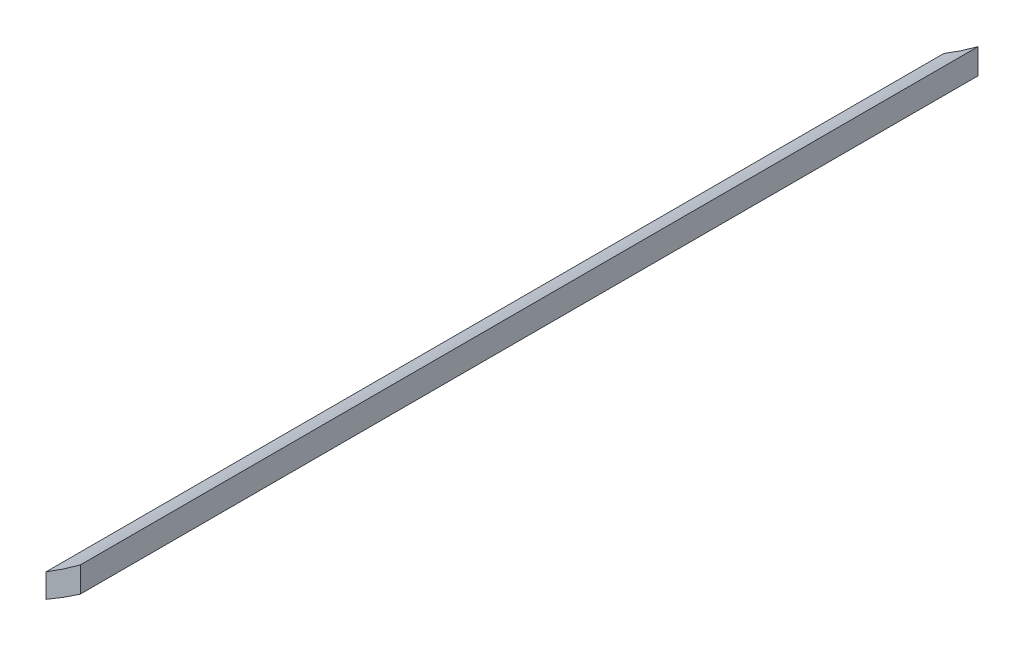
ISO-10303-21;
HEADER;
FILE_DESCRIPTION(('STEP AP214'),'2;1');
FILE_NAME('part.step','',(''),(''),'','','');
FILE_SCHEMA(('AUTOMOTIVE_DESIGN { 1 0 10303 214 1 1 1 1 }'));
ENDSEC;
DATA;
#1=APPLICATION_CONTEXT('core data for automotive mechanical design processes');
#2=APPLICATION_PROTOCOL_DEFINITION('international standard','automotive_design',2000,#1);
#3=PRODUCT_CONTEXT('',#1,'mechanical');
#4=PRODUCT('Part','Part','',(#3));
#5=PRODUCT_RELATED_PRODUCT_CATEGORY('part','',(#4));
#6=PRODUCT_DEFINITION_FORMATION('','',#4);
#7=PRODUCT_DEFINITION_CONTEXT('part definition',#1,'design');
#8=PRODUCT_DEFINITION('design','',#6,#7);
#9=PRODUCT_DEFINITION_SHAPE('','',#8);
#10=(LENGTH_UNIT() NAMED_UNIT(*) SI_UNIT(.MILLI.,.METRE.));
#11=(NAMED_UNIT(*) PLANE_ANGLE_UNIT() SI_UNIT($,.RADIAN.));
#12=(NAMED_UNIT(*) SI_UNIT($,.STERADIAN.) SOLID_ANGLE_UNIT());
#13=UNCERTAINTY_MEASURE_WITH_UNIT(LENGTH_MEASURE(1.E-05),#10,'distance_accuracy_value','');
#14=(GEOMETRIC_REPRESENTATION_CONTEXT(3) GLOBAL_UNCERTAINTY_ASSIGNED_CONTEXT((#13)) GLOBAL_UNIT_ASSIGNED_CONTEXT((#10,
#11,#12)) REPRESENTATION_CONTEXT('',''));
#15=CARTESIAN_POINT('',(0.,0.,0.));
#16=DIRECTION('',(0.,0.,1.));
#17=DIRECTION('',(1.,0.,0.));
#18=AXIS2_PLACEMENT_3D('',#15,#16,#17);
#19=CARTESIAN_POINT('',(124.258422810137,-49.206656057137,55.));
#20=CARTESIAN_POINT('',(123.864604952284,-49.4967683658135,55.));
#21=CARTESIAN_POINT('',(123.46498976773,-49.7784278854798,55.));
#22=CARTESIAN_POINT('',(122.76228468259,-50.2462797192281,55.));
#23=CARTESIAN_POINT('',(122.462623418311,-50.4374711545895,55.));
#24=CARTESIAN_POINT('',(122.158422810137,-50.6220440020814,55.));
#25=B_SPLINE_CURVE_WITH_KNOTS('',3,(#19,#20,#21,#22,#23,#24),.UNSPECIFIED.,.F.,.F.,(4,2,4),
(0.114062220421862,0.249999999999999,0.348787923125498),.UNSPECIFIED.);
#26=DIRECTION('',(0.,0.,-1.));
#27=VECTOR('',#26,1.);
#28=SURFACE_OF_LINEAR_EXTRUSION('',#25,#27);
#29=CARTESIAN_POINT('',(124.258422810137,-49.206656057137,0.));
#30=CARTESIAN_POINT('',(123.864604952284,-49.4967683658135,0.));
#31=CARTESIAN_POINT('',(123.46498976773,-49.7784278854798,0.));
#32=CARTESIAN_POINT('',(122.76228468259,-50.2462797192281,0.));
#33=CARTESIAN_POINT('',(122.462623418311,-50.4374711545895,0.));
#34=CARTESIAN_POINT('',(122.158422810137,-50.6220440020814,0.));
#35=B_SPLINE_CURVE_WITH_KNOTS('',3,(#29,#30,#31,#32,#33,#34),.UNSPECIFIED.,.F.,.F.,(4,2,4),
(0.114062220421862,0.249999999999999,0.348787923125498),.UNSPECIFIED.);
#36=CARTESIAN_POINT('',(124.258422810137,-49.2066560571371,0.));
#37=VERTEX_POINT('',#36);
#38=CARTESIAN_POINT('',(122.158422810137,-50.6220440020814,0.));
#39=VERTEX_POINT('',#38);
#40=EDGE_CURVE('E202',#37,#39,#35,.T.);
#41=ORIENTED_EDGE('',*,*,#40,.T.);
#42=DIRECTION('',(0.,0.,-1.));
#43=VECTOR('',#42,1.);
#44=CARTESIAN_POINT('',(122.158422810137,-50.6220440020814,55.));
#45=LINE('',#44,#43);
#46=CARTESIAN_POINT('',(122.158422810137,-50.6220440020814,55.));
#47=VERTEX_POINT('',#46);
#48=EDGE_CURVE('E11',#47,#39,#45,.T.);
#49=ORIENTED_EDGE('',*,*,#48,.F.);
#50=CARTESIAN_POINT('',(122.158422810137,-50.6220440020814,55.));
#51=CARTESIAN_POINT('',(122.462623418311,-50.4374711545895,55.));
#52=CARTESIAN_POINT('',(122.76228468259,-50.2462797192281,55.));
#53=CARTESIAN_POINT('',(123.46498976773,-49.7784278854798,55.));
#54=CARTESIAN_POINT('',(123.864604952284,-49.4967683658135,55.));
#55=CARTESIAN_POINT('',(124.258422810137,-49.206656057137,55.));
#56=B_SPLINE_CURVE_WITH_KNOTS('',3,(#50,#51,#52,#53,#54,#55),.UNSPECIFIED.,.F.,.F.,(4,2,4),
(0.114062220421862,0.212850143547361,0.348787923125498),.UNSPECIFIED.);
#57=CARTESIAN_POINT('',(124.258422810137,-49.2066560571371,55.));
#58=VERTEX_POINT('',#57);
#59=EDGE_CURVE('E99',#58,#47,#56,.F.);
#60=ORIENTED_EDGE('',*,*,#59,.F.);
#61=DIRECTION('',(0.,0.,-1.));
#62=VECTOR('',#61,1.);
#63=CARTESIAN_POINT('',(124.258422810137,-49.2066560571371,55.));
#64=LINE('',#63,#62);
#65=EDGE_CURVE('E187',#58,#37,#64,.T.);
#66=ORIENTED_EDGE('',*,*,#65,.T.);
#67=EDGE_LOOP('',(#41,#49,#60,#66));
#68=FACE_BOUND('',#67,.T.);
#69=ADVANCED_FACE('F39',(#68),#28,.F.);
#70=CARTESIAN_POINT('',(122.158422810137,-50.6220440020814,55.));
#71=DIRECTION('',(1.,0.,0.));
#72=DIRECTION('',(0.,0.,-1.));
#73=AXIS2_PLACEMENT_3D('',#70,#71,#72);
#74=PLANE('',#73);
#75=DIRECTION('',(0.,-1.,0.));
#76=VECTOR('',#75,1.);
#77=CARTESIAN_POINT('',(122.158422810137,-50.6220440020814,0.));
#78=LINE('',#77,#76);
#79=CARTESIAN_POINT('',(122.158422810137,-52.0819137652417,0.));
#80=VERTEX_POINT('',#79);
#81=EDGE_CURVE('E105',#39,#80,#78,.T.);
#82=ORIENTED_EDGE('',*,*,#81,.T.);
#83=DIRECTION('',(0.,0.,-1.));
#84=VECTOR('',#83,1.);
#85=CARTESIAN_POINT('',(122.158422810137,-52.0819137652417,55.));
#86=LINE('',#85,#84);
#87=CARTESIAN_POINT('',(122.158422810137,-52.0819137652417,55.));
#88=VERTEX_POINT('',#87);
#89=EDGE_CURVE('E53',#88,#80,#86,.T.);
#90=ORIENTED_EDGE('',*,*,#89,.F.);
#91=DIRECTION('',(0.,-1.,0.));
#92=VECTOR('',#91,1.);
#93=CARTESIAN_POINT('',(122.158422810137,-50.6220440020814,55.));
#94=LINE('',#93,#92);
#95=EDGE_CURVE('E93',#47,#88,#94,.T.);
#96=ORIENTED_EDGE('',*,*,#95,.F.);
#97=ORIENTED_EDGE('',*,*,#48,.T.);
#98=EDGE_LOOP('',(#82,#90,#96,#97));
#99=FACE_BOUND('',#98,.T.);
#100=ADVANCED_FACE('F104',(#99),#74,.F.);
#101=CARTESIAN_POINT('',(122.158422810137,-52.0819137652417,55.));
#102=CARTESIAN_POINT('',(122.466925520807,-51.9079399314948,55.));
#103=CARTESIAN_POINT('',(122.771253518607,-51.7267928018192,55.));
#104=CARTESIAN_POINT('',(123.473575804438,-51.2888831627379,55.));
#105=CARTESIAN_POINT('',(123.868912344743,-51.0270588173674,55.));
#106=CARTESIAN_POINT('',(124.258422810137,-50.7562014190225,55.));
#107=B_SPLINE_CURVE_WITH_KNOTS('',3,(#101,#102,#103,#104,#105,#106),.UNSPECIFIED.,.F.,.F.,(4,2,
4),(0.649205424795794,0.750000000000001,0.88522318251672),.UNSPECIFIED.);
#108=DIRECTION('',(0.,0.,-1.));
#109=VECTOR('',#108,1.);
#110=SURFACE_OF_LINEAR_EXTRUSION('',#107,#109);
#111=CARTESIAN_POINT('',(122.158422810137,-52.0819137652417,0.));
#112=CARTESIAN_POINT('',(122.466925520807,-51.9079399314948,0.));
#113=CARTESIAN_POINT('',(122.771253518607,-51.7267928018192,0.));
#114=CARTESIAN_POINT('',(123.473575804438,-51.2888831627379,0.));
#115=CARTESIAN_POINT('',(123.868912344743,-51.0270588173674,0.));
#116=CARTESIAN_POINT('',(124.258422810137,-50.7562014190225,0.));
#117=B_SPLINE_CURVE_WITH_KNOTS('',3,(#111,#112,#113,#114,#115,#116),.UNSPECIFIED.,.F.,.F.,(4,2,
4),(0.649205424795794,0.750000000000001,0.88522318251672),.UNSPECIFIED.);
#118=CARTESIAN_POINT('',(124.258422810137,-50.7562014190225,0.));
#119=VERTEX_POINT('',#118);
#120=EDGE_CURVE('E79',#80,#119,#117,.T.);
#121=ORIENTED_EDGE('',*,*,#120,.T.);
#122=DIRECTION('',(0.,0.,-1.));
#123=VECTOR('',#122,1.);
#124=CARTESIAN_POINT('',(124.258422810137,-50.7562014190225,55.));
#125=LINE('',#124,#123);
#126=CARTESIAN_POINT('',(124.258422810137,-50.7562014190225,55.));
#127=VERTEX_POINT('',#126);
#128=EDGE_CURVE('E107',#127,#119,#125,.T.);
#129=ORIENTED_EDGE('',*,*,#128,.F.);
#130=CARTESIAN_POINT('',(124.258422810137,-50.7562014190225,55.));
#131=CARTESIAN_POINT('',(123.868912344743,-51.0270588173674,55.));
#132=CARTESIAN_POINT('',(123.473575804438,-51.2888831627379,55.));
#133=CARTESIAN_POINT('',(122.771253518607,-51.7267928018192,55.));
#134=CARTESIAN_POINT('',(122.466925520807,-51.9079399314948,55.));
#135=CARTESIAN_POINT('',(122.158422810137,-52.0819137652417,55.));
#136=B_SPLINE_CURVE_WITH_KNOTS('',3,(#130,#131,#132,#133,#134,#135),.UNSPECIFIED.,.F.,.F.,(4,2,
4),(0.649205424795794,0.784428607312513,0.88522318251672),.UNSPECIFIED.);
#137=EDGE_CURVE('E96',#88,#127,#136,.F.);
#138=ORIENTED_EDGE('',*,*,#137,.F.);
#139=ORIENTED_EDGE('',*,*,#89,.T.);
#140=EDGE_LOOP('',(#121,#129,#138,#139));
#141=FACE_BOUND('',#140,.T.);
#142=ADVANCED_FACE('F110',(#141),#110,.F.);
#143=CARTESIAN_POINT('',(124.258422810137,-49.2066560571371,55.));
#144=DIRECTION('',(-1.,0.,0.));
#145=DIRECTION('',(0.,-1.,0.));
#146=AXIS2_PLACEMENT_3D('',#143,#144,#145);
#147=PLANE('',#146);
#148=DIRECTION('',(0.,1.,0.));
#149=VECTOR('',#148,1.);
#150=CARTESIAN_POINT('',(124.258422810137,-49.2066560571371,0.));
#151=LINE('',#150,#149);
#152=EDGE_CURVE('E86',#119,#37,#151,.T.);
#153=ORIENTED_EDGE('',*,*,#152,.T.);
#154=ORIENTED_EDGE('',*,*,#65,.F.);
#155=DIRECTION('',(0.,1.,0.));
#156=VECTOR('',#155,1.);
#157=CARTESIAN_POINT('',(124.258422810137,-49.2066560571371,55.));
#158=LINE('',#157,#156);
#159=EDGE_CURVE('E62',#127,#58,#158,.T.);
#160=ORIENTED_EDGE('',*,*,#159,.F.);
#161=ORIENTED_EDGE('',*,*,#128,.T.);
#162=EDGE_LOOP('',(#153,#154,#160,#161));
#163=FACE_BOUND('',#162,.T.);
#164=ADVANCED_FACE('F130',(#163),#147,.F.);
#165=CARTESIAN_POINT('',(123.224446310629,-49.9377130856892,55.));
#166=DIRECTION('',(0.,0.,1.));
#167=DIRECTION('',(1.,0.,0.));
#168=AXIS2_PLACEMENT_3D('',#165,#166,#167);
#169=PLANE('',#168);
#170=ORIENTED_EDGE('',*,*,#59,.T.);
#171=ORIENTED_EDGE('',*,*,#95,.T.);
#172=ORIENTED_EDGE('',*,*,#137,.T.);
#173=ORIENTED_EDGE('',*,*,#159,.T.);
#174=EDGE_LOOP('',(#170,#171,#172,#173));
#175=FACE_BOUND('',#174,.T.);
#176=ADVANCED_FACE('F94',(#175),#169,.T.);
#177=CARTESIAN_POINT('',(123.224446310629,-49.9377130856892,0.));
#178=DIRECTION('',(0.,0.,1.));
#179=DIRECTION('',(1.,0.,0.));
#180=AXIS2_PLACEMENT_3D('',#177,#178,#179);
#181=PLANE('',#180);
#182=ORIENTED_EDGE('',*,*,#40,.F.);
#183=ORIENTED_EDGE('',*,*,#152,.F.);
#184=ORIENTED_EDGE('',*,*,#120,.F.);
#185=ORIENTED_EDGE('',*,*,#81,.F.);
#186=EDGE_LOOP('',(#182,#183,#184,#185));
#187=FACE_BOUND('',#186,.T.);
#188=ADVANCED_FACE('F160',(#187),#181,.F.);
#189=CLOSED_SHELL('',(#69,#100,#142,#164,#176,#188));
#190=MANIFOLD_SOLID_BREP('B2',#189);
#191=ADVANCED_BREP_SHAPE_REPRESENTATION('',(#18,#190),#14);
#192=SHAPE_DEFINITION_REPRESENTATION(#9,#191);
ENDSEC;
END-ISO-10303-21;
